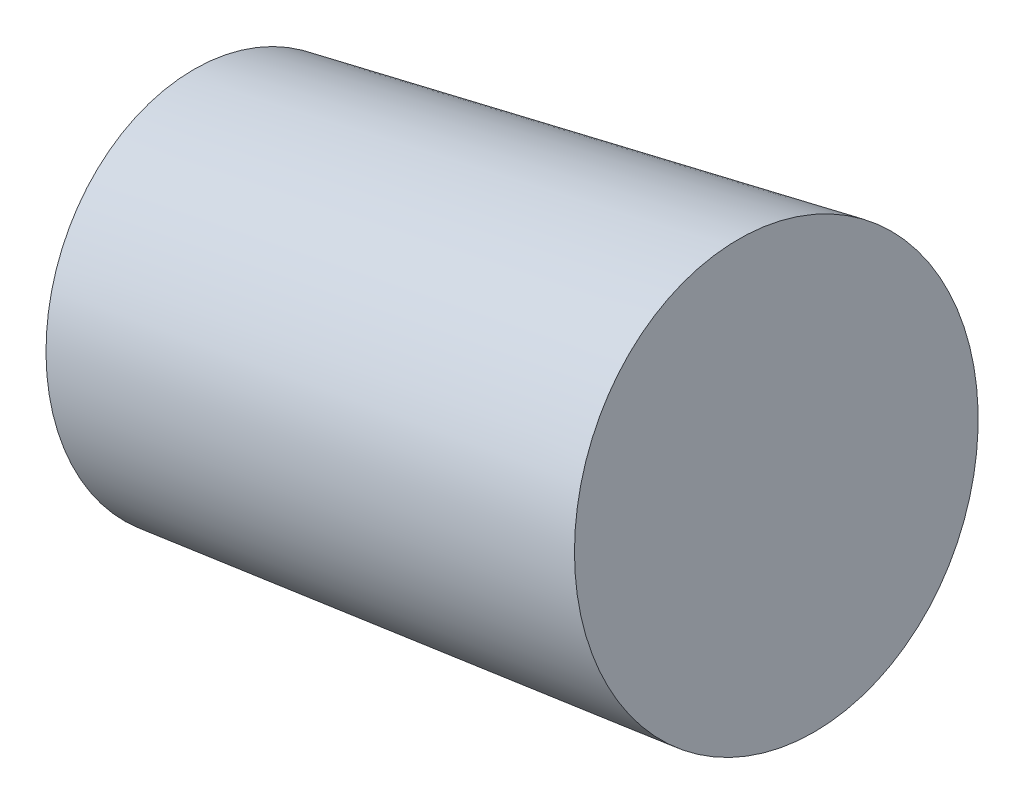
ISO-10303-21;
HEADER;
FILE_DESCRIPTION(('STEP AP214'),'2;1');
FILE_NAME('part.step','',(''),(''),'','','');
FILE_SCHEMA(('AUTOMOTIVE_DESIGN { 1 0 10303 214 1 1 1 1 }'));
ENDSEC;
DATA;
#1=APPLICATION_CONTEXT('core data for automotive mechanical design processes');
#2=APPLICATION_PROTOCOL_DEFINITION('international standard','automotive_design',2000,#1);
#3=PRODUCT_CONTEXT('',#1,'mechanical');
#4=PRODUCT('Part','Part','',(#3));
#5=PRODUCT_RELATED_PRODUCT_CATEGORY('part','',(#4));
#6=PRODUCT_DEFINITION_FORMATION('','',#4);
#7=PRODUCT_DEFINITION_CONTEXT('part definition',#1,'design');
#8=PRODUCT_DEFINITION('design','',#6,#7);
#9=PRODUCT_DEFINITION_SHAPE('','',#8);
#10=(LENGTH_UNIT() NAMED_UNIT(*) SI_UNIT(.MILLI.,.METRE.));
#11=(NAMED_UNIT(*) PLANE_ANGLE_UNIT() SI_UNIT($,.RADIAN.));
#12=(NAMED_UNIT(*) SI_UNIT($,.STERADIAN.) SOLID_ANGLE_UNIT());
#13=UNCERTAINTY_MEASURE_WITH_UNIT(LENGTH_MEASURE(1.E-05),#10,'distance_accuracy_value','');
#14=(GEOMETRIC_REPRESENTATION_CONTEXT(3) GLOBAL_UNCERTAINTY_ASSIGNED_CONTEXT((#13)) GLOBAL_UNIT_ASSIGNED_CONTEXT((#10,
#11,#12)) REPRESENTATION_CONTEXT('',''));
#15=CARTESIAN_POINT('',(0.,0.,0.));
#16=DIRECTION('',(0.,0.,1.));
#17=DIRECTION('',(1.,0.,0.));
#18=AXIS2_PLACEMENT_3D('',#15,#16,#17);
#19=CARTESIAN_POINT('',(9.52605818813054,18.0626180951541,-2.79692176783091));
#20=DIRECTION('',(0.981803266444129,0.189900884673136,0.));
#21=DIRECTION('',(0.,0.,1.));
#22=AXIS2_PLACEMENT_3D('',#19,#20,#21);
#23=PLANE('',#22);
#24=CARTESIAN_POINT('',(10.0571961062032,15.316591167509,0.));
#25=DIRECTION('',(0.981803266444129,0.189900884673136,0.));
#26=DIRECTION('',(0.189900884673136,-0.981803266444128,0.));
#27=AXIS2_PLACEMENT_3D('',#24,#25,#26);
#28=CIRCLE('',#27,2.7969217678309);
#29=CARTESIAN_POINT('',(10.5883340242758,12.570564239864,0.));
#30=VERTEX_POINT('',#29);
#31=EDGE_CURVE('E22',#30,#30,#28,.F.);
#32=ORIENTED_EDGE('',*,*,#31,.F.);
#33=EDGE_LOOP('',(#32));
#34=FACE_BOUND('',#33,.T.);
#35=ADVANCED_FACE('F15',(#34),#23,.T.);
#36=CARTESIAN_POINT('',(2.8014541539535,11.345461936107,-2.52099568427172));
#37=DIRECTION('',(-0.981803266444129,-0.189900884673136,0.));
#38=DIRECTION('',(0.,0.,1.));
#39=AXIS2_PLACEMENT_3D('',#36,#37,#38);
#40=PLANE('',#39);
#41=CARTESIAN_POINT('',(2.32271481459741,13.820583881769,0.));
#42=DIRECTION('',(-0.981803266444129,-0.189900884673136,0.));
#43=DIRECTION('',(-0.189900884673135,0.981803266444119,-1.42331045152869E-07));
#44=AXIS2_PLACEMENT_3D('',#41,#42,#43);
#45=CIRCLE('',#44,2.5209958351701);
#46=CARTESIAN_POINT('',(1.84397547524132,16.295705827431,-3.58815972045791E-07));
#47=VERTEX_POINT('',#46);
#48=EDGE_CURVE('E10',#47,#47,#45,.T.);
#49=ORIENTED_EDGE('',*,*,#48,.T.);
#50=EDGE_LOOP('',(#49));
#51=FACE_BOUND('',#50,.T.);
#52=ADVANCED_FACE('F30',(#51),#40,.T.);
#53=CARTESIAN_POINT('',(10.0571961062032,15.316591167509,0.));
#54=DIRECTION('',(0.981803266444129,0.189900884673136,0.));
#55=DIRECTION('',(0.189900884673136,-0.981803266444129,0.));
#56=AXIS2_PLACEMENT_3D('',#53,#54,#55);
#57=CONICAL_SURFACE('',#56,2.7969217678309,0.035011304794993);
#58=ORIENTED_EDGE('',*,*,#48,.F.);
#59=EDGE_LOOP('',(#58));
#60=FACE_BOUND('',#59,.T.);
#61=ORIENTED_EDGE('',*,*,#31,.T.);
#62=EDGE_LOOP('',(#61));
#63=FACE_BOUND('',#62,.T.);
#64=ADVANCED_FACE('F17',(#60,#63),#57,.T.);
#65=CLOSED_SHELL('',(#35,#52,#64));
#66=MANIFOLD_SOLID_BREP('B1',#65);
#67=ADVANCED_BREP_SHAPE_REPRESENTATION('',(#18,#66),#14);
#68=SHAPE_DEFINITION_REPRESENTATION(#9,#67);
ENDSEC;
END-ISO-10303-21;
